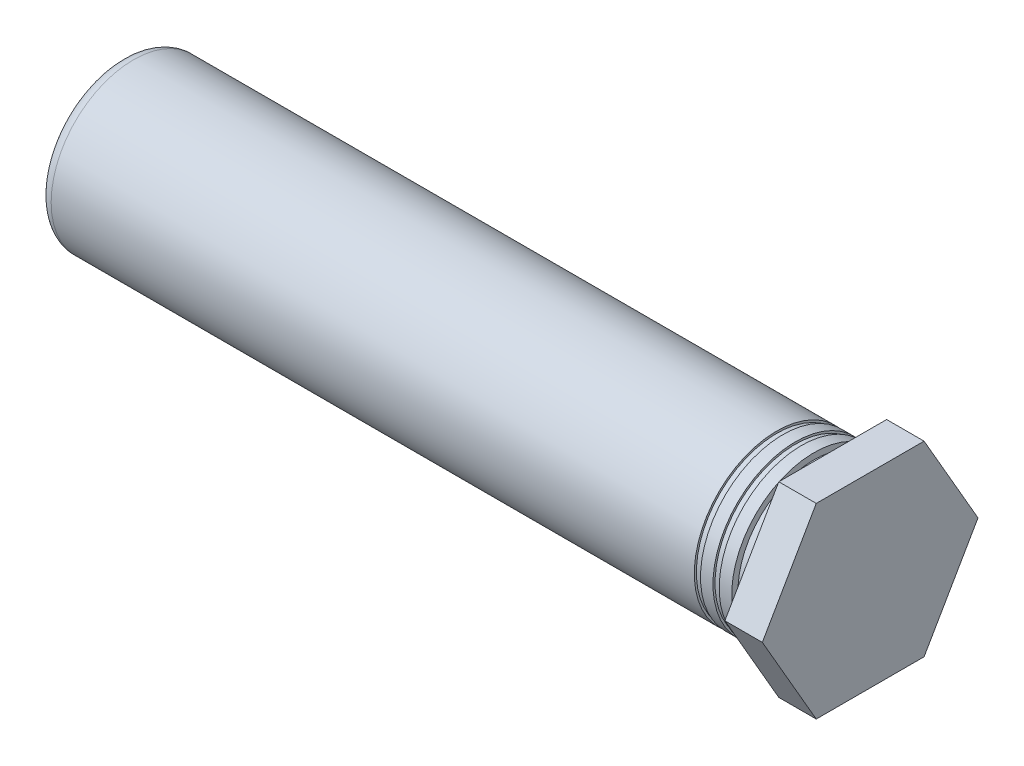
ISO-10303-21;
HEADER;
FILE_DESCRIPTION(('STEP AP214'),'2;1');
FILE_NAME('part.step','',(''),(''),'','','');
FILE_SCHEMA(('AUTOMOTIVE_DESIGN { 1 0 10303 214 1 1 1 1 }'));
ENDSEC;
DATA;
#1=APPLICATION_CONTEXT('core data for automotive mechanical design processes');
#2=APPLICATION_PROTOCOL_DEFINITION('international standard','automotive_design',2000,#1);
#3=PRODUCT_CONTEXT('',#1,'mechanical');
#4=PRODUCT('Part','Part','',(#3));
#5=PRODUCT_RELATED_PRODUCT_CATEGORY('part','',(#4));
#6=PRODUCT_DEFINITION_FORMATION('','',#4);
#7=PRODUCT_DEFINITION_CONTEXT('part definition',#1,'design');
#8=PRODUCT_DEFINITION('design','',#6,#7);
#9=PRODUCT_DEFINITION_SHAPE('','',#8);
#10=(LENGTH_UNIT() NAMED_UNIT(*) SI_UNIT(.MILLI.,.METRE.));
#11=(NAMED_UNIT(*) PLANE_ANGLE_UNIT() SI_UNIT($,.RADIAN.));
#12=(NAMED_UNIT(*) SI_UNIT($,.STERADIAN.) SOLID_ANGLE_UNIT());
#13=UNCERTAINTY_MEASURE_WITH_UNIT(LENGTH_MEASURE(1.E-05),#10,'distance_accuracy_value','');
#14=(GEOMETRIC_REPRESENTATION_CONTEXT(3) GLOBAL_UNCERTAINTY_ASSIGNED_CONTEXT((#13)) GLOBAL_UNIT_ASSIGNED_CONTEXT((#10,
#11,#12)) REPRESENTATION_CONTEXT('',''));
#15=CARTESIAN_POINT('',(0.,0.,0.));
#16=DIRECTION('',(0.,0.,1.));
#17=DIRECTION('',(1.,0.,0.));
#18=AXIS2_PLACEMENT_3D('',#15,#16,#17);
#19=CARTESIAN_POINT('',(0.9525,-2.3749,-2.7422983085969));
#20=DIRECTION('',(1.,0.,0.));
#21=DIRECTION('',(0.,1.,0.));
#22=AXIS2_PLACEMENT_3D('',#19,#20,#21);
#23=PLANE('',#22);
#24=DIRECTION('',(0.,0.,1.));
#25=VECTOR('',#24,1.);
#26=CARTESIAN_POINT('',(0.9525,-2.3749,0.));
#27=LINE('',#26,#25);
#28=CARTESIAN_POINT('',(0.9525,-2.3749,-1.3711491542984));
#29=VERTEX_POINT('',#28);
#30=CARTESIAN_POINT('',(0.9525,-2.3749,1.3711491542984));
#31=VERTEX_POINT('',#30);
#32=EDGE_CURVE('E78',#29,#31,#27,.T.);
#33=ORIENTED_EDGE('',*,*,#32,.F.);
#34=DIRECTION('',(0.,-0.86602540378443,0.500000000000015));
#35=VECTOR('',#34,1.);
#36=CARTESIAN_POINT('',(0.9525,-1.18745,-2.05672373144765));
#37=LINE('',#36,#35);
#38=CARTESIAN_POINT('',(0.9525,2.50003124105391E-10,-2.74229830845256));
#39=VERTEX_POINT('',#38);
#40=EDGE_CURVE('E74',#39,#29,#37,.T.);
#41=ORIENTED_EDGE('',*,*,#40,.F.);
#42=DIRECTION('',(0.,-0.866025403784429,-0.500000000000016));
#43=VECTOR('',#42,1.);
#44=CARTESIAN_POINT('',(0.9525,1.18745,-2.05672373144765));
#45=LINE('',#44,#43);
#46=CARTESIAN_POINT('',(0.9525,2.3749,-1.3711491542984));
#47=VERTEX_POINT('',#46);
#48=EDGE_CURVE('E76',#47,#39,#45,.T.);
#49=ORIENTED_EDGE('',*,*,#48,.F.);
#50=DIRECTION('',(0.,0.,-1.));
#51=VECTOR('',#50,1.);
#52=CARTESIAN_POINT('',(0.9525,2.3749,0.));
#53=LINE('',#52,#51);
#54=CARTESIAN_POINT('',(0.9525,2.3749,1.3711491542984));
#55=VERTEX_POINT('',#54);
#56=EDGE_CURVE('E60',#55,#47,#53,.T.);
#57=ORIENTED_EDGE('',*,*,#56,.F.);
#58=DIRECTION('',(0.,0.866025403784429,-0.500000000000016));
#59=VECTOR('',#58,1.);
#60=CARTESIAN_POINT('',(0.9525,1.18745,2.05672373144765));
#61=LINE('',#60,#59);
#62=CARTESIAN_POINT('',(0.9525,2.49999673740398E-10,2.74229830845256));
#63=VERTEX_POINT('',#62);
#64=EDGE_CURVE('E120',#63,#55,#61,.T.);
#65=ORIENTED_EDGE('',*,*,#64,.F.);
#66=DIRECTION('',(0.,0.866025403784429,0.500000000000016));
#67=VECTOR('',#66,1.);
#68=CARTESIAN_POINT('',(0.9525,-1.18745,2.05672373144765));
#69=LINE('',#68,#67);
#70=EDGE_CURVE('E107',#31,#63,#69,.T.);
#71=ORIENTED_EDGE('',*,*,#70,.F.);
#72=EDGE_LOOP('',(#33,#41,#49,#57,#65,#71));
#73=FACE_BOUND('',#72,.T.);
#74=ADVANCED_FACE('F17',(#73),#23,.T.);
#75=CARTESIAN_POINT('',(0.9525,0.,-2.7422983085969));
#76=DIRECTION('',(0.,0.500000000000016,-0.866025403784429));
#77=DIRECTION('',(-1.,0.,0.));
#78=AXIS2_PLACEMENT_3D('',#75,#76,#77);
#79=PLANE('',#78);
#80=CARTESIAN_POINT('',(0.9525,0.,-2.7422983085969));
#81=CARTESIAN_POINT('',(0.,0.,-2.7422983085969));
#82=B_SPLINE_CURVE_WITH_KNOTS('',1,(#80,#81),.UNSPECIFIED.,.F.,.F.,(2,2),(0.,0.9525),.UNSPECIFIED.);
#83=CARTESIAN_POINT('',(0.,0.,-2.7422983085969));
#84=VERTEX_POINT('',#83);
#85=EDGE_CURVE('E82',#84,#39,#82,.F.);
#86=ORIENTED_EDGE('',*,*,#85,.F.);
#87=DIRECTION('',(0.,-0.866025403784429,-0.500000000000016));
#88=VECTOR('',#87,1.);
#89=CARTESIAN_POINT('',(0.,2.3749,-1.3711491542984));
#90=LINE('',#89,#88);
#91=CARTESIAN_POINT('',(0.,2.3749,-1.3711491542984));
#92=VERTEX_POINT('',#91);
#93=EDGE_CURVE('E21',#92,#84,#90,.T.);
#94=ORIENTED_EDGE('',*,*,#93,.F.);
#95=CARTESIAN_POINT('',(0.9525,2.3749,-1.3711491542984));
#96=CARTESIAN_POINT('',(0.,2.3749,-1.3711491542984));
#97=B_SPLINE_CURVE_WITH_KNOTS('',1,(#95,#96),.UNSPECIFIED.,.F.,.F.,(2,2),(0.,0.9525),.UNSPECIFIED.);
#98=EDGE_CURVE('E86',#47,#92,#97,.T.);
#99=ORIENTED_EDGE('',*,*,#98,.F.);
#100=ORIENTED_EDGE('',*,*,#48,.T.);
#101=EDGE_LOOP('',(#86,#94,#99,#100));
#102=FACE_BOUND('',#101,.T.);
#103=ADVANCED_FACE('F84',(#102),#79,.T.);
#104=CARTESIAN_POINT('',(0.9525,-2.3749,-1.3711491542984));
#105=DIRECTION('',(0.,-0.500000000000015,-0.86602540378443));
#106=DIRECTION('',(-1.,0.,0.));
#107=AXIS2_PLACEMENT_3D('',#104,#105,#106);
#108=PLANE('',#107);
#109=CARTESIAN_POINT('',(0.9525,-2.3749,-1.3711491542984));
#110=CARTESIAN_POINT('',(0.,-2.3749,-1.3711491542984));
#111=B_SPLINE_CURVE_WITH_KNOTS('',1,(#109,#110),.UNSPECIFIED.,.F.,.F.,(2,2),(0.,0.9525),.UNSPECIFIED.);
#112=CARTESIAN_POINT('',(0.,-2.3749,-1.3711491542984));
#113=VERTEX_POINT('',#112);
#114=EDGE_CURVE('E92',#113,#29,#111,.F.);
#115=ORIENTED_EDGE('',*,*,#114,.F.);
#116=DIRECTION('',(0.,-0.86602540378443,0.500000000000015));
#117=VECTOR('',#116,1.);
#118=CARTESIAN_POINT('',(0.,0.,-2.7422983085969));
#119=LINE('',#118,#117);
#120=EDGE_CURVE('E90',#84,#113,#119,.T.);
#121=ORIENTED_EDGE('',*,*,#120,.F.);
#122=ORIENTED_EDGE('',*,*,#85,.T.);
#123=ORIENTED_EDGE('',*,*,#40,.T.);
#124=EDGE_LOOP('',(#115,#121,#122,#123));
#125=FACE_BOUND('',#124,.T.);
#126=ADVANCED_FACE('F88',(#125),#108,.T.);
#127=CARTESIAN_POINT('',(0.9525,-2.3749,1.3711491542984));
#128=DIRECTION('',(0.,-1.,0.));
#129=DIRECTION('',(-1.,0.,0.));
#130=AXIS2_PLACEMENT_3D('',#127,#128,#129);
#131=PLANE('',#130);
#132=CARTESIAN_POINT('',(0.9525,-2.3749,1.3711491542984));
#133=CARTESIAN_POINT('',(0.,-2.3749,1.3711491542984));
#134=B_SPLINE_CURVE_WITH_KNOTS('',1,(#132,#133),.UNSPECIFIED.,.F.,.F.,(2,2),(0.,0.9525),.UNSPECIFIED.);
#135=CARTESIAN_POINT('',(0.,-2.3749,1.3711491542984));
#136=VERTEX_POINT('',#135);
#137=EDGE_CURVE('E115',#136,#31,#134,.F.);
#138=ORIENTED_EDGE('',*,*,#137,.F.);
#139=DIRECTION('',(0.,0.,1.));
#140=VECTOR('',#139,1.);
#141=CARTESIAN_POINT('',(0.,-2.3749,0.));
#142=LINE('',#141,#140);
#143=EDGE_CURVE('E108',#113,#136,#142,.T.);
#144=ORIENTED_EDGE('',*,*,#143,.F.);
#145=ORIENTED_EDGE('',*,*,#114,.T.);
#146=ORIENTED_EDGE('',*,*,#32,.T.);
#147=EDGE_LOOP('',(#138,#144,#145,#146));
#148=FACE_BOUND('',#147,.T.);
#149=ADVANCED_FACE('F385',(#148),#131,.T.);
#150=CARTESIAN_POINT('',(0.9525,0.,2.7422983085969));
#151=DIRECTION('',(0.,-0.500000000000016,0.866025403784429));
#152=DIRECTION('',(-1.,0.,0.));
#153=AXIS2_PLACEMENT_3D('',#150,#151,#152);
#154=PLANE('',#153);
#155=CARTESIAN_POINT('',(0.9525,0.,2.7422983085969));
#156=CARTESIAN_POINT('',(0.,0.,2.7422983085969));
#157=B_SPLINE_CURVE_WITH_KNOTS('',1,(#155,#156),.UNSPECIFIED.,.F.,.F.,(2,2),(0.,0.9525),.UNSPECIFIED.);
#158=CARTESIAN_POINT('',(0.,0.,2.7422983085969));
#159=VERTEX_POINT('',#158);
#160=EDGE_CURVE('E126',#159,#63,#157,.F.);
#161=ORIENTED_EDGE('',*,*,#160,.F.);
#162=DIRECTION('',(0.,0.866025403784429,0.500000000000016));
#163=VECTOR('',#162,1.);
#164=CARTESIAN_POINT('',(0.,-2.3749,1.3711491542984));
#165=LINE('',#164,#163);
#166=EDGE_CURVE('E114',#136,#159,#165,.T.);
#167=ORIENTED_EDGE('',*,*,#166,.F.);
#168=ORIENTED_EDGE('',*,*,#137,.T.);
#169=ORIENTED_EDGE('',*,*,#70,.T.);
#170=EDGE_LOOP('',(#161,#167,#168,#169));
#171=FACE_BOUND('',#170,.T.);
#172=ADVANCED_FACE('F208',(#171),#154,.T.);
#173=CARTESIAN_POINT('',(0.9525,2.3749,1.3711491542984));
#174=DIRECTION('',(0.,0.500000000000016,0.866025403784429));
#175=DIRECTION('',(-1.,0.,0.));
#176=AXIS2_PLACEMENT_3D('',#173,#174,#175);
#177=PLANE('',#176);
#178=CARTESIAN_POINT('',(0.9525,2.3749,1.3711491542984));
#179=CARTESIAN_POINT('',(0.,2.3749,1.3711491542984));
#180=B_SPLINE_CURVE_WITH_KNOTS('',1,(#178,#179),.UNSPECIFIED.,.F.,.F.,(2,2),(0.,0.9525),.UNSPECIFIED.);
#181=CARTESIAN_POINT('',(0.,2.3749,1.3711491542984));
#182=VERTEX_POINT('',#181);
#183=EDGE_CURVE('E125',#182,#55,#180,.F.);
#184=ORIENTED_EDGE('',*,*,#183,.F.);
#185=DIRECTION('',(0.,0.866025403784429,-0.500000000000016));
#186=VECTOR('',#185,1.);
#187=CARTESIAN_POINT('',(0.,0.,2.7422983085969));
#188=LINE('',#187,#186);
#189=EDGE_CURVE('E175',#159,#182,#188,.T.);
#190=ORIENTED_EDGE('',*,*,#189,.F.);
#191=ORIENTED_EDGE('',*,*,#160,.T.);
#192=ORIENTED_EDGE('',*,*,#64,.T.);
#193=EDGE_LOOP('',(#184,#190,#191,#192));
#194=FACE_BOUND('',#193,.T.);
#195=ADVANCED_FACE('F199',(#194),#177,.T.);
#196=CARTESIAN_POINT('',(0.9525,2.3749,-1.3711491542984));
#197=DIRECTION('',(0.,1.,0.));
#198=DIRECTION('',(-1.,0.,0.));
#199=AXIS2_PLACEMENT_3D('',#196,#197,#198);
#200=PLANE('',#199);
#201=ORIENTED_EDGE('',*,*,#98,.T.);
#202=DIRECTION('',(0.,0.,-1.));
#203=VECTOR('',#202,1.);
#204=CARTESIAN_POINT('',(0.,2.3749,0.));
#205=LINE('',#204,#203);
#206=EDGE_CURVE('E174',#182,#92,#205,.T.);
#207=ORIENTED_EDGE('',*,*,#206,.F.);
#208=ORIENTED_EDGE('',*,*,#183,.T.);
#209=ORIENTED_EDGE('',*,*,#56,.T.);
#210=EDGE_LOOP('',(#201,#207,#208,#209));
#211=FACE_BOUND('',#210,.T.);
#212=ADVANCED_FACE('F197',(#211),#200,.T.);
#213=CARTESIAN_POINT('',(0.,2.3749,-2.7422983085969));
#214=DIRECTION('',(-1.,0.,0.));
#215=DIRECTION('',(0.,-1.,0.));
#216=AXIS2_PLACEMENT_3D('',#213,#214,#215);
#217=PLANE('',#216);
#218=ORIENTED_EDGE('',*,*,#189,.T.);
#219=ORIENTED_EDGE('',*,*,#206,.T.);
#220=ORIENTED_EDGE('',*,*,#93,.T.);
#221=ORIENTED_EDGE('',*,*,#120,.T.);
#222=ORIENTED_EDGE('',*,*,#143,.T.);
#223=ORIENTED_EDGE('',*,*,#166,.T.);
#224=EDGE_LOOP('',(#218,#219,#220,#221,#222,#223));
#225=FACE_BOUND('',#224,.T.);
#226=CARTESIAN_POINT('',(0.,0.,0.));
#227=DIRECTION('',(1.,0.,0.));
#228=DIRECTION('',(0.,0.,-1.));
#229=AXIS2_PLACEMENT_3D('',#226,#227,#228);
#230=CIRCLE('',#229,1.9371733333333);
#231=CARTESIAN_POINT('',(0.,0.,-1.9371733333333));
#232=VERTEX_POINT('',#231);
#233=EDGE_CURVE('E171',#232,#232,#230,.F.);
#234=ORIENTED_EDGE('',*,*,#233,.F.);
#235=EDGE_LOOP('',(#234));
#236=FACE_BOUND('',#235,.T.);
#237=ADVANCED_FACE('F194',(#225,#236),#217,.T.);
#238=CARTESIAN_POINT('',(-0.47498,0.,0.));
#239=DIRECTION('',(1.,0.,0.));
#240=DIRECTION('',(0.,0.,-1.));
#241=AXIS2_PLACEMENT_3D('',#238,#239,#240);
#242=CYLINDRICAL_SURFACE('',#241,1.9371733333333);
#243=CARTESIAN_POINT('',(-0.47498,0.,0.));
#244=DIRECTION('',(1.,0.,0.));
#245=DIRECTION('',(0.,0.,-1.));
#246=AXIS2_PLACEMENT_3D('',#243,#244,#245);
#247=CIRCLE('',#246,1.9371733333333);
#248=CARTESIAN_POINT('',(-0.47498,0.,-1.9371733333333));
#249=VERTEX_POINT('',#248);
#250=EDGE_CURVE('E168',#249,#249,#247,.F.);
#251=ORIENTED_EDGE('',*,*,#250,.F.);
#252=EDGE_LOOP('',(#251));
#253=FACE_BOUND('',#252,.T.);
#254=ORIENTED_EDGE('',*,*,#233,.T.);
#255=EDGE_LOOP('',(#254));
#256=FACE_BOUND('',#255,.T.);
#257=ADVANCED_FACE('F206',(#253,#256),#242,.T.);
#258=CARTESIAN_POINT('',(-0.47498,-2.0955,2.13741));
#259=DIRECTION('',(1.,0.,0.));
#260=DIRECTION('',(0.,0.,-1.));
#261=AXIS2_PLACEMENT_3D('',#258,#259,#260);
#262=PLANE('',#261);
#263=CARTESIAN_POINT('',(-0.47498,0.,0.));
#264=DIRECTION('',(1.,0.,0.));
#265=DIRECTION('',(0.,0.,-1.));
#266=AXIS2_PLACEMENT_3D('',#263,#264,#265);
#267=CIRCLE('',#266,2.0955);
#268=CARTESIAN_POINT('',(-0.47498,0.,-2.0955));
#269=VERTEX_POINT('',#268);
#270=EDGE_CURVE('E165',#269,#269,#267,.F.);
#271=ORIENTED_EDGE('',*,*,#270,.F.);
#272=EDGE_LOOP('',(#271));
#273=FACE_BOUND('',#272,.T.);
#274=ORIENTED_EDGE('',*,*,#250,.T.);
#275=EDGE_LOOP('',(#274));
#276=FACE_BOUND('',#275,.T.);
#277=ADVANCED_FACE('F353',(#273,#276),#262,.T.);
#278=CARTESIAN_POINT('',(-0.79163333333333,0.,0.));
#279=DIRECTION('',(1.,0.,0.));
#280=DIRECTION('',(0.,0.,-1.));
#281=AXIS2_PLACEMENT_3D('',#278,#279,#280);
#282=CYLINDRICAL_SURFACE('',#281,2.0955);
#283=ORIENTED_EDGE('',*,*,#270,.T.);
#284=EDGE_LOOP('',(#283));
#285=FACE_BOUND('',#284,.T.);
#286=CARTESIAN_POINT('',(-0.79163333333333,0.,0.));
#287=DIRECTION('',(1.,0.,0.));
#288=DIRECTION('',(0.,0.,-1.));
#289=AXIS2_PLACEMENT_3D('',#286,#287,#288);
#290=CIRCLE('',#289,2.0955);
#291=CARTESIAN_POINT('',(-0.79163333333333,0.,-2.0955));
#292=VERTEX_POINT('',#291);
#293=EDGE_CURVE('E162',#292,#292,#290,.F.);
#294=ORIENTED_EDGE('',*,*,#293,.F.);
#295=EDGE_LOOP('',(#294));
#296=FACE_BOUND('',#295,.T.);
#297=ADVANCED_FACE('F345',(#285,#296),#282,.T.);
#298=CARTESIAN_POINT('',(-0.79163333333333,-2.0955,-2.0955));
#299=DIRECTION('',(-1.,0.,0.));
#300=DIRECTION('',(0.,0.,1.));
#301=AXIS2_PLACEMENT_3D('',#298,#299,#300);
#302=PLANE('',#301);
#303=CARTESIAN_POINT('',(-0.79163333333333,0.,0.));
#304=DIRECTION('',(1.,0.,0.));
#305=DIRECTION('',(0.,0.,-1.));
#306=AXIS2_PLACEMENT_3D('',#303,#304,#305);
#307=CIRCLE('',#306,2.0427244444444);
#308=CARTESIAN_POINT('',(-0.79163333333333,0.,-2.0427244444444));
#309=VERTEX_POINT('',#308);
#310=EDGE_CURVE('E159',#309,#309,#307,.F.);
#311=ORIENTED_EDGE('',*,*,#310,.F.);
#312=EDGE_LOOP('',(#311));
#313=FACE_BOUND('',#312,.T.);
#314=ORIENTED_EDGE('',*,*,#293,.T.);
#315=EDGE_LOOP('',(#314));
#316=FACE_BOUND('',#315,.T.);
#317=ADVANCED_FACE('F337',(#313,#316),#302,.T.);
#318=CARTESIAN_POINT('',(-0.94996,0.,0.));
#319=DIRECTION('',(1.,0.,0.));
#320=DIRECTION('',(0.,0.,-1.));
#321=AXIS2_PLACEMENT_3D('',#318,#319,#320);
#322=CYLINDRICAL_SURFACE('',#321,2.0427244444444);
#323=CARTESIAN_POINT('',(-0.94996,0.,0.));
#324=DIRECTION('',(1.,0.,0.));
#325=DIRECTION('',(0.,0.,-1.));
#326=AXIS2_PLACEMENT_3D('',#323,#324,#325);
#327=CIRCLE('',#326,2.0427244444444);
#328=CARTESIAN_POINT('',(-0.94996,0.,-2.0427244444444));
#329=VERTEX_POINT('',#328);
#330=EDGE_CURVE('E156',#329,#329,#327,.F.);
#331=ORIENTED_EDGE('',*,*,#330,.F.);
#332=EDGE_LOOP('',(#331));
#333=FACE_BOUND('',#332,.T.);
#334=ORIENTED_EDGE('',*,*,#310,.T.);
#335=EDGE_LOOP('',(#334));
#336=FACE_BOUND('',#335,.T.);
#337=ADVANCED_FACE('F329',(#333,#336),#322,.T.);
#338=CARTESIAN_POINT('',(-0.94996,-2.0955,2.13741));
#339=DIRECTION('',(1.,0.,0.));
#340=DIRECTION('',(0.,0.,-1.));
#341=AXIS2_PLACEMENT_3D('',#338,#339,#340);
#342=PLANE('',#341);
#343=CARTESIAN_POINT('',(-0.94996,0.,0.));
#344=DIRECTION('',(1.,0.,0.));
#345=DIRECTION('',(0.,0.,-1.));
#346=AXIS2_PLACEMENT_3D('',#343,#344,#345);
#347=CIRCLE('',#346,2.0955);
#348=CARTESIAN_POINT('',(-0.94996,0.,-2.0955));
#349=VERTEX_POINT('',#348);
#350=EDGE_CURVE('E153',#349,#349,#347,.F.);
#351=ORIENTED_EDGE('',*,*,#350,.F.);
#352=EDGE_LOOP('',(#351));
#353=FACE_BOUND('',#352,.T.);
#354=ORIENTED_EDGE('',*,*,#330,.T.);
#355=EDGE_LOOP('',(#354));
#356=FACE_BOUND('',#355,.T.);
#357=ADVANCED_FACE('F321',(#353,#356),#342,.T.);
#358=CARTESIAN_POINT('',(-1.2666133333333,0.,0.));
#359=DIRECTION('',(1.,0.,0.));
#360=DIRECTION('',(0.,0.,-1.));
#361=AXIS2_PLACEMENT_3D('',#358,#359,#360);
#362=CYLINDRICAL_SURFACE('',#361,2.0955);
#363=ORIENTED_EDGE('',*,*,#350,.T.);
#364=EDGE_LOOP('',(#363));
#365=FACE_BOUND('',#364,.T.);
#366=CARTESIAN_POINT('',(-1.2666133333333,0.,0.));
#367=DIRECTION('',(1.,0.,0.));
#368=DIRECTION('',(0.,0.,-1.));
#369=AXIS2_PLACEMENT_3D('',#366,#367,#368);
#370=CIRCLE('',#369,2.0955);
#371=CARTESIAN_POINT('',(-1.2666133333333,0.,-2.0955));
#372=VERTEX_POINT('',#371);
#373=EDGE_CURVE('E150',#372,#372,#370,.F.);
#374=ORIENTED_EDGE('',*,*,#373,.F.);
#375=EDGE_LOOP('',(#374));
#376=FACE_BOUND('',#375,.T.);
#377=ADVANCED_FACE('F314',(#365,#376),#362,.T.);
#378=CARTESIAN_POINT('',(-1.2666133333333,-2.0955,-2.0955));
#379=DIRECTION('',(-1.,0.,0.));
#380=DIRECTION('',(0.,0.,1.));
#381=AXIS2_PLACEMENT_3D('',#378,#379,#380);
#382=PLANE('',#381);
#383=CARTESIAN_POINT('',(-1.2666133333333,0.,0.));
#384=DIRECTION('',(1.,0.,0.));
#385=DIRECTION('',(0.,0.,-1.));
#386=AXIS2_PLACEMENT_3D('',#383,#384,#385);
#387=CIRCLE('',#386,2.0427244444444);
#388=CARTESIAN_POINT('',(-1.2666133333333,0.,-2.0427244444444));
#389=VERTEX_POINT('',#388);
#390=EDGE_CURVE('E147',#389,#389,#387,.F.);
#391=ORIENTED_EDGE('',*,*,#390,.F.);
#392=EDGE_LOOP('',(#391));
#393=FACE_BOUND('',#392,.T.);
#394=ORIENTED_EDGE('',*,*,#373,.T.);
#395=EDGE_LOOP('',(#394));
#396=FACE_BOUND('',#395,.T.);
#397=ADVANCED_FACE('F243',(#393,#396),#382,.T.);
#398=CARTESIAN_POINT('',(-1.42494,0.,0.));
#399=DIRECTION('',(1.,0.,0.));
#400=DIRECTION('',(0.,0.,-1.));
#401=AXIS2_PLACEMENT_3D('',#398,#399,#400);
#402=CYLINDRICAL_SURFACE('',#401,2.0427244444444);
#403=CARTESIAN_POINT('',(-1.42494,0.,0.));
#404=DIRECTION('',(1.,0.,0.));
#405=DIRECTION('',(0.,0.,-1.));
#406=AXIS2_PLACEMENT_3D('',#403,#404,#405);
#407=CIRCLE('',#406,2.0427244444444);
#408=CARTESIAN_POINT('',(-1.42494,0.,-2.0427244444444));
#409=VERTEX_POINT('',#408);
#410=EDGE_CURVE('E144',#409,#409,#407,.F.);
#411=ORIENTED_EDGE('',*,*,#410,.F.);
#412=EDGE_LOOP('',(#411));
#413=FACE_BOUND('',#412,.T.);
#414=ORIENTED_EDGE('',*,*,#390,.T.);
#415=EDGE_LOOP('',(#414));
#416=FACE_BOUND('',#415,.T.);
#417=ADVANCED_FACE('F235',(#413,#416),#402,.T.);
#418=CARTESIAN_POINT('',(-2.1462622033853,0.,0.));
#419=DIRECTION('',(-1.,0.,0.));
#420=DIRECTION('',(0.,-1.,0.));
#421=AXIS2_PLACEMENT_3D('',#418,#419,#420);
#422=CONICAL_SURFACE('',#421,0.,1.0471975511966);
#423=CARTESIAN_POINT('',(-2.1462622033853,0.,0.));
#424=VERTEX_POINT('',#423);
#425=VERTEX_LOOP('',#424);
#426=FACE_BOUND('',#425,.T.);
#427=CARTESIAN_POINT('',(-2.8575,0.,0.));
#428=DIRECTION('',(1.,0.,0.));
#429=DIRECTION('',(0.,1.,0.));
#430=AXIS2_PLACEMENT_3D('',#427,#428,#429);
#431=CIRCLE('',#430,1.2319);
#432=CARTESIAN_POINT('',(-2.8575,1.2319,0.));
#433=VERTEX_POINT('',#432);
#434=EDGE_CURVE('E143',#433,#433,#431,.T.);
#435=ORIENTED_EDGE('',*,*,#434,.F.);
#436=EDGE_LOOP('',(#435));
#437=FACE_BOUND('',#436,.T.);
#438=ADVANCED_FACE('F232',(#426,#437),#422,.F.);
#439=CARTESIAN_POINT('',(-1.42494,-2.0955,2.13741));
#440=DIRECTION('',(1.,0.,0.));
#441=DIRECTION('',(0.,0.,-1.));
#442=AXIS2_PLACEMENT_3D('',#439,#440,#441);
#443=PLANE('',#442);
#444=CARTESIAN_POINT('',(-1.42494,0.,0.));
#445=DIRECTION('',(1.,0.,0.));
#446=DIRECTION('',(0.,0.,-1.));
#447=AXIS2_PLACEMENT_3D('',#444,#445,#446);
#448=CIRCLE('',#447,2.0955);
#449=CARTESIAN_POINT('',(-1.42494,0.,-2.0955));
#450=VERTEX_POINT('',#449);
#451=EDGE_CURVE('E140',#450,#450,#448,.F.);
#452=ORIENTED_EDGE('',*,*,#451,.F.);
#453=EDGE_LOOP('',(#452));
#454=FACE_BOUND('',#453,.T.);
#455=ORIENTED_EDGE('',*,*,#410,.T.);
#456=EDGE_LOOP('',(#455));
#457=FACE_BOUND('',#456,.T.);
#458=ADVANCED_FACE('F234',(#454,#457),#443,.T.);
#459=CARTESIAN_POINT('',(-2.8575,0.,0.));
#460=DIRECTION('',(-1.,0.,0.));
#461=DIRECTION('',(0.,-1.,0.));
#462=AXIS2_PLACEMENT_3D('',#459,#460,#461);
#463=CYLINDRICAL_SURFACE('',#462,1.2319);
#464=CARTESIAN_POINT('',(-8.5725,0.,0.));
#465=DIRECTION('',(-1.,0.,0.));
#466=DIRECTION('',(0.,-1.,0.));
#467=AXIS2_PLACEMENT_3D('',#464,#465,#466);
#468=CIRCLE('',#467,1.2319);
#469=CARTESIAN_POINT('',(-8.5725,-1.23189999999999,0.));
#470=VERTEX_POINT('',#469);
#471=EDGE_CURVE('E137',#470,#470,#468,.F.);
#472=ORIENTED_EDGE('',*,*,#471,.F.);
#473=EDGE_LOOP('',(#472));
#474=FACE_BOUND('',#473,.T.);
#475=ORIENTED_EDGE('',*,*,#434,.T.);
#476=EDGE_LOOP('',(#475));
#477=FACE_BOUND('',#476,.T.);
#478=ADVANCED_FACE('F230',(#474,#477),#463,.F.);
#479=CARTESIAN_POINT('',(-17.78,0.,0.));
#480=DIRECTION('',(1.,0.,0.));
#481=DIRECTION('',(0.,0.,-1.));
#482=AXIS2_PLACEMENT_3D('',#479,#480,#481);
#483=CYLINDRICAL_SURFACE('',#482,2.0955);
#484=CARTESIAN_POINT('',(-17.78,0.,0.));
#485=DIRECTION('',(-1.,0.,0.));
#486=DIRECTION('',(0.,0.,1.));
#487=AXIS2_PLACEMENT_3D('',#484,#485,#486);
#488=CIRCLE('',#487,2.0955);
#489=CARTESIAN_POINT('',(-17.78,0.,2.0955));
#490=VERTEX_POINT('',#489);
#491=EDGE_CURVE('E136',#490,#490,#488,.T.);
#492=ORIENTED_EDGE('',*,*,#491,.F.);
#493=EDGE_LOOP('',(#492));
#494=FACE_BOUND('',#493,.T.);
#495=ORIENTED_EDGE('',*,*,#451,.T.);
#496=EDGE_LOOP('',(#495));
#497=FACE_BOUND('',#496,.T.);
#498=ADVANCED_FACE('F250',(#494,#497),#483,.T.);
#499=CARTESIAN_POINT('',(-8.5725,1.256538,-1.2319));
#500=DIRECTION('',(1.,0.,0.));
#501=DIRECTION('',(0.,0.,1.));
#502=AXIS2_PLACEMENT_3D('',#499,#500,#501);
#503=PLANE('',#502);
#504=CARTESIAN_POINT('',(-8.5725,0.,0.));
#505=DIRECTION('',(-1.,0.,0.));
#506=DIRECTION('',(0.,0.,1.));
#507=AXIS2_PLACEMENT_3D('',#504,#505,#506);
#508=CIRCLE('',#507,1.1049);
#509=CARTESIAN_POINT('',(-8.5725,0.,1.1049));
#510=VERTEX_POINT('',#509);
#511=EDGE_CURVE('E133',#510,#510,#508,.F.);
#512=ORIENTED_EDGE('',*,*,#511,.F.);
#513=EDGE_LOOP('',(#512));
#514=FACE_BOUND('',#513,.T.);
#515=ORIENTED_EDGE('',*,*,#471,.T.);
#516=EDGE_LOOP('',(#515));
#517=FACE_BOUND('',#516,.T.);
#518=ADVANCED_FACE('F254',(#514,#517),#503,.T.);
#519=CARTESIAN_POINT('',(-17.78,0.,0.));
#520=DIRECTION('',(1.,0.,0.));
#521=DIRECTION('',(0.,0.,-1.));
#522=AXIS2_PLACEMENT_3D('',#519,#520,#521);
#523=TOROIDAL_SURFACE('',#522,1.778,0.3175);
#524=CARTESIAN_POINT('',(-18.0975,0.,0.));
#525=DIRECTION('',(1.,0.,0.));
#526=DIRECTION('',(0.,0.,-1.));
#527=AXIS2_PLACEMENT_3D('',#524,#525,#526);
#528=CIRCLE('',#527,1.778);
#529=CARTESIAN_POINT('',(-18.0975,0.,-1.778));
#530=VERTEX_POINT('',#529);
#531=EDGE_CURVE('E130',#530,#530,#528,.F.);
#532=ORIENTED_EDGE('',*,*,#531,.F.);
#533=EDGE_LOOP('',(#532));
#534=FACE_BOUND('',#533,.T.);
#535=ORIENTED_EDGE('',*,*,#491,.T.);
#536=EDGE_LOOP('',(#535));
#537=FACE_BOUND('',#536,.T.);
#538=ADVANCED_FACE('F258',(#534,#537),#523,.T.);
#539=CARTESIAN_POINT('',(-8.5725,0.,0.));
#540=DIRECTION('',(-1.,0.,0.));
#541=DIRECTION('',(0.,0.,1.));
#542=AXIS2_PLACEMENT_3D('',#539,#540,#541);
#543=CYLINDRICAL_SURFACE('',#542,1.1049);
#544=ORIENTED_EDGE('',*,*,#511,.T.);
#545=EDGE_LOOP('',(#544));
#546=FACE_BOUND('',#545,.T.);
#547=CARTESIAN_POINT('',(-17.78,0.,0.));
#548=DIRECTION('',(1.,0.,0.));
#549=DIRECTION('',(0.,0.,-1.));
#550=AXIS2_PLACEMENT_3D('',#547,#548,#549);
#551=CIRCLE('',#550,1.1049);
#552=CARTESIAN_POINT('',(-17.78,0.,-1.1049));
#553=VERTEX_POINT('',#552);
#554=EDGE_CURVE('E27',#553,#553,#551,.T.);
#555=ORIENTED_EDGE('',*,*,#554,.F.);
#556=EDGE_LOOP('',(#555));
#557=FACE_BOUND('',#556,.T.);
#558=ADVANCED_FACE('F217',(#546,#557),#543,.F.);
#559=CARTESIAN_POINT('',(-18.0975,1.778,-1.81356));
#560=DIRECTION('',(-1.,0.,0.));
#561=DIRECTION('',(0.,-1.,0.));
#562=AXIS2_PLACEMENT_3D('',#559,#560,#561);
#563=PLANE('',#562);
#564=ORIENTED_EDGE('',*,*,#531,.T.);
#565=EDGE_LOOP('',(#564));
#566=FACE_BOUND('',#565,.T.);
#567=CARTESIAN_POINT('',(-18.0975,0.,0.));
#568=DIRECTION('',(-1.,0.,0.));
#569=DIRECTION('',(0.,0.,1.));
#570=AXIS2_PLACEMENT_3D('',#567,#568,#569);
#571=CIRCLE('',#570,1.4224);
#572=CARTESIAN_POINT('',(-18.0975,0.,1.4224));
#573=VERTEX_POINT('',#572);
#574=EDGE_CURVE('E11',#573,#573,#571,.T.);
#575=ORIENTED_EDGE('',*,*,#574,.F.);
#576=EDGE_LOOP('',(#575));
#577=FACE_BOUND('',#576,.T.);
#578=ADVANCED_FACE('F212',(#566,#577),#563,.T.);
#579=CARTESIAN_POINT('',(-17.78,0.,0.));
#580=DIRECTION('',(-1.,0.,0.));
#581=DIRECTION('',(0.,0.,1.));
#582=AXIS2_PLACEMENT_3D('',#579,#580,#581);
#583=CONICAL_SURFACE('',#582,1.1049,0.785398163397445);
#584=ORIENTED_EDGE('',*,*,#574,.T.);
#585=EDGE_LOOP('',(#584));
#586=FACE_BOUND('',#585,.T.);
#587=ORIENTED_EDGE('',*,*,#554,.T.);
#588=EDGE_LOOP('',(#587));
#589=FACE_BOUND('',#588,.T.);
#590=ADVANCED_FACE('F19',(#586,#589),#583,.F.);
#591=CLOSED_SHELL('',(#74,#103,#126,#149,#172,#195,#212,#237,#257,#277,#297,#317,#337,#357,#377,
#397,#417,#438,#458,#478,#498,#518,#538,#558,#578,#590));
#592=MANIFOLD_SOLID_BREP('B1',#591);
#593=ADVANCED_BREP_SHAPE_REPRESENTATION('',(#18,#592),#14);
#594=SHAPE_DEFINITION_REPRESENTATION(#9,#593);
ENDSEC;
END-ISO-10303-21;
